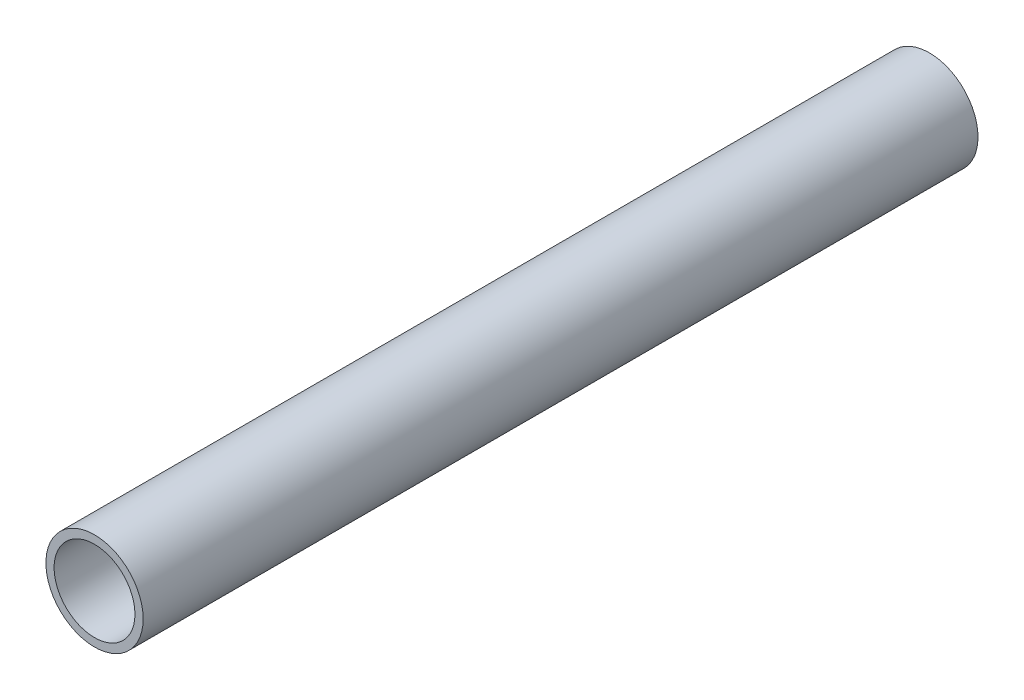
ISO-10303-21;
HEADER;
FILE_DESCRIPTION(('STEP AP214'),'2;1');
FILE_NAME('part.step','',(''),(''),'','','');
FILE_SCHEMA(('AUTOMOTIVE_DESIGN { 1 0 10303 214 1 1 1 1 }'));
ENDSEC;
DATA;
#1=APPLICATION_CONTEXT('core data for automotive mechanical design processes');
#2=APPLICATION_PROTOCOL_DEFINITION('international standard','automotive_design',2000,#1);
#3=PRODUCT_CONTEXT('',#1,'mechanical');
#4=PRODUCT('Part','Part','',(#3));
#5=PRODUCT_RELATED_PRODUCT_CATEGORY('part','',(#4));
#6=PRODUCT_DEFINITION_FORMATION('','',#4);
#7=PRODUCT_DEFINITION_CONTEXT('part definition',#1,'design');
#8=PRODUCT_DEFINITION('design','',#6,#7);
#9=PRODUCT_DEFINITION_SHAPE('','',#8);
#10=(LENGTH_UNIT() NAMED_UNIT(*) SI_UNIT(.MILLI.,.METRE.));
#11=(NAMED_UNIT(*) PLANE_ANGLE_UNIT() SI_UNIT($,.RADIAN.));
#12=(NAMED_UNIT(*) SI_UNIT($,.STERADIAN.) SOLID_ANGLE_UNIT());
#13=UNCERTAINTY_MEASURE_WITH_UNIT(LENGTH_MEASURE(1.E-05),#10,'distance_accuracy_value','');
#14=(GEOMETRIC_REPRESENTATION_CONTEXT(3) GLOBAL_UNCERTAINTY_ASSIGNED_CONTEXT((#13)) GLOBAL_UNIT_ASSIGNED_CONTEXT((#10,
#11,#12)) REPRESENTATION_CONTEXT('',''));
#15=CARTESIAN_POINT('',(0.,0.,0.));
#16=DIRECTION('',(0.,0.,1.));
#17=DIRECTION('',(1.,0.,0.));
#18=AXIS2_PLACEMENT_3D('',#15,#16,#17);
#19=CARTESIAN_POINT('',(0.,0.,361.95));
#20=DIRECTION('',(0.,0.,1.));
#21=DIRECTION('',(1.,0.,0.));
#22=AXIS2_PLACEMENT_3D('',#19,#20,#21);
#23=PLANE('',#22);
#24=CARTESIAN_POINT('',(0.,0.,361.95));
#25=DIRECTION('',(0.,0.,1.));
#26=DIRECTION('',(1.,0.,0.));
#27=AXIS2_PLACEMENT_3D('',#24,#25,#26);
#28=CIRCLE('',#27,21.082);
#29=CARTESIAN_POINT('',(21.082,0.,361.95));
#30=VERTEX_POINT('',#29);
#31=EDGE_CURVE('E12',#30,#30,#28,.T.);
#32=ORIENTED_EDGE('',*,*,#31,.T.);
#33=EDGE_LOOP('',(#32));
#34=FACE_BOUND('',#33,.T.);
#35=CARTESIAN_POINT('',(0.,0.,361.95));
#36=DIRECTION('',(0.,0.,1.));
#37=DIRECTION('',(1.,0.,0.));
#38=AXIS2_PLACEMENT_3D('',#35,#36,#37);
#39=CIRCLE('',#38,17.526);
#40=CARTESIAN_POINT('',(17.526,0.,361.95));
#41=VERTEX_POINT('',#40);
#42=EDGE_CURVE('E51',#41,#41,#39,.T.);
#43=ORIENTED_EDGE('',*,*,#42,.F.);
#44=EDGE_LOOP('',(#43));
#45=FACE_BOUND('',#44,.T.);
#46=ADVANCED_FACE('F40',(#34,#45),#23,.T.);
#47=CARTESIAN_POINT('',(0.,0.,0.));
#48=DIRECTION('',(0.,0.,1.));
#49=DIRECTION('',(1.,0.,0.));
#50=AXIS2_PLACEMENT_3D('',#47,#48,#49);
#51=PLANE('',#50);
#52=CARTESIAN_POINT('',(0.,0.,0.));
#53=DIRECTION('',(0.,0.,1.));
#54=DIRECTION('',(1.,0.,0.));
#55=AXIS2_PLACEMENT_3D('',#52,#53,#54);
#56=CIRCLE('',#55,21.082);
#57=CARTESIAN_POINT('',(21.082,0.,0.));
#58=VERTEX_POINT('',#57);
#59=EDGE_CURVE('E44',#58,#58,#56,.T.);
#60=ORIENTED_EDGE('',*,*,#59,.F.);
#61=EDGE_LOOP('',(#60));
#62=FACE_BOUND('',#61,.T.);
#63=CARTESIAN_POINT('',(0.,0.,0.));
#64=DIRECTION('',(0.,0.,1.));
#65=DIRECTION('',(1.,0.,0.));
#66=AXIS2_PLACEMENT_3D('',#63,#64,#65);
#67=CIRCLE('',#66,17.526);
#68=CARTESIAN_POINT('',(17.526,0.,0.));
#69=VERTEX_POINT('',#68);
#70=EDGE_CURVE('E53',#69,#69,#67,.T.);
#71=ORIENTED_EDGE('',*,*,#70,.T.);
#72=EDGE_LOOP('',(#71));
#73=FACE_BOUND('',#72,.T.);
#74=ADVANCED_FACE('F63',(#62,#73),#51,.F.);
#75=CARTESIAN_POINT('',(0.,0.,361.95));
#76=DIRECTION('',(0.,0.,-1.));
#77=DIRECTION('',(-1.,0.,0.));
#78=AXIS2_PLACEMENT_3D('',#75,#76,#77);
#79=CYLINDRICAL_SURFACE('',#78,21.082);
#80=ORIENTED_EDGE('',*,*,#31,.F.);
#81=EDGE_LOOP('',(#80));
#82=FACE_BOUND('',#81,.T.);
#83=ORIENTED_EDGE('',*,*,#59,.T.);
#84=EDGE_LOOP('',(#83));
#85=FACE_BOUND('',#84,.T.);
#86=ADVANCED_FACE('F42',(#82,#85),#79,.T.);
#87=CARTESIAN_POINT('',(0.,0.,361.95));
#88=DIRECTION('',(0.,0.,-1.));
#89=DIRECTION('',(-1.,0.,0.));
#90=AXIS2_PLACEMENT_3D('',#87,#88,#89);
#91=CYLINDRICAL_SURFACE('',#90,17.526);
#92=ORIENTED_EDGE('',*,*,#42,.T.);
#93=EDGE_LOOP('',(#92));
#94=FACE_BOUND('',#93,.T.);
#95=ORIENTED_EDGE('',*,*,#70,.F.);
#96=EDGE_LOOP('',(#95));
#97=FACE_BOUND('',#96,.T.);
#98=ADVANCED_FACE('F59',(#94,#97),#91,.F.);
#99=CLOSED_SHELL('',(#46,#74,#86,#98));
#100=MANIFOLD_SOLID_BREP('B2',#99);
#101=ADVANCED_BREP_SHAPE_REPRESENTATION('',(#18,#100),#14);
#102=SHAPE_DEFINITION_REPRESENTATION(#9,#101);
ENDSEC;
END-ISO-10303-21;
